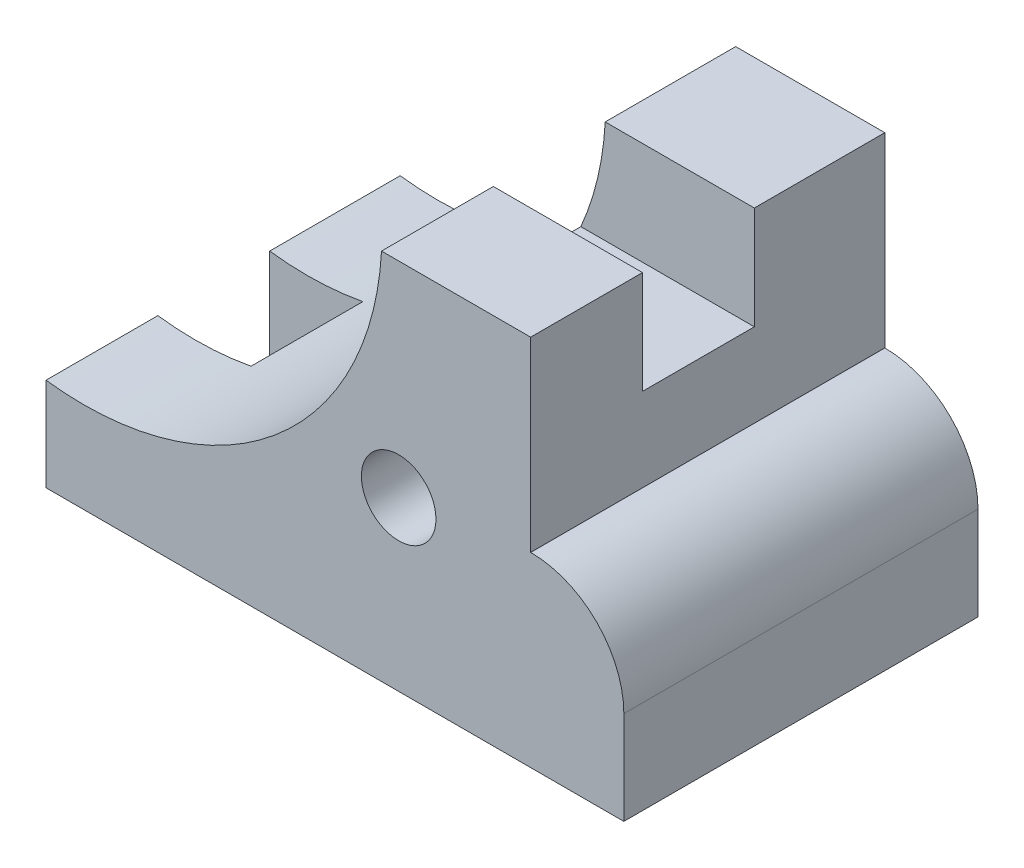
ISO-10303-21;
HEADER;
FILE_DESCRIPTION(('STEP AP214'),'2;1');
FILE_NAME('part.step','',(''),(''),'','','');
FILE_SCHEMA(('AUTOMOTIVE_DESIGN { 1 0 10303 214 1 1 1 1 }'));
ENDSEC;
DATA;
#1=APPLICATION_CONTEXT('core data for automotive mechanical design processes');
#2=APPLICATION_PROTOCOL_DEFINITION('international standard','automotive_design',2000,#1);
#3=PRODUCT_CONTEXT('',#1,'mechanical');
#4=PRODUCT('Part','Part','',(#3));
#5=PRODUCT_RELATED_PRODUCT_CATEGORY('part','',(#4));
#6=PRODUCT_DEFINITION_FORMATION('','',#4);
#7=PRODUCT_DEFINITION_CONTEXT('part definition',#1,'design');
#8=PRODUCT_DEFINITION('design','',#6,#7);
#9=PRODUCT_DEFINITION_SHAPE('','',#8);
#10=(LENGTH_UNIT() NAMED_UNIT(*) SI_UNIT(.MILLI.,.METRE.));
#11=(NAMED_UNIT(*) PLANE_ANGLE_UNIT() SI_UNIT($,.RADIAN.));
#12=(NAMED_UNIT(*) SI_UNIT($,.STERADIAN.) SOLID_ANGLE_UNIT());
#13=UNCERTAINTY_MEASURE_WITH_UNIT(LENGTH_MEASURE(1.E-05),#10,'distance_accuracy_value','');
#14=(GEOMETRIC_REPRESENTATION_CONTEXT(3) GLOBAL_UNCERTAINTY_ASSIGNED_CONTEXT((#13)) GLOBAL_UNIT_ASSIGNED_CONTEXT((#10,
#11,#12)) REPRESENTATION_CONTEXT('',''));
#15=CARTESIAN_POINT('',(0.,0.,0.));
#16=DIRECTION('',(0.,0.,1.));
#17=DIRECTION('',(1.,0.,0.));
#18=AXIS2_PLACEMENT_3D('',#15,#16,#17);
#19=CARTESIAN_POINT('',(0.,0.,-60.325));
#20=DIRECTION('',(-1.,0.,0.));
#21=DIRECTION('',(0.,0.,1.));
#22=AXIS2_PLACEMENT_3D('',#19,#20,#21);
#23=PLANE('',#22);
#24=DIRECTION('',(0.,0.,1.));
#25=VECTOR('',#24,1.);
#26=CARTESIAN_POINT('',(0.,15.875,-60.325));
#27=LINE('',#26,#25);
#28=CARTESIAN_POINT('',(0.,15.875,-19.05));
#29=VERTEX_POINT('',#28);
#30=CARTESIAN_POINT('',(0.,15.875,0.));
#31=VERTEX_POINT('',#30);
#32=EDGE_CURVE('E44',#29,#31,#27,.T.);
#33=ORIENTED_EDGE('',*,*,#32,.F.);
#34=DIRECTION('',(0.,-1.,0.));
#35=VECTOR('',#34,1.);
#36=CARTESIAN_POINT('',(0.,29.8196,-19.05));
#37=LINE('',#36,#35);
#38=CARTESIAN_POINT('',(0.,0.,-19.05));
#39=VERTEX_POINT('',#38);
#40=EDGE_CURVE('E183',#29,#39,#37,.T.);
#41=ORIENTED_EDGE('',*,*,#40,.T.);
#42=DIRECTION('',(0.,0.,1.));
#43=VECTOR('',#42,1.);
#44=CARTESIAN_POINT('',(0.,0.,-60.325));
#45=LINE('',#44,#43);
#46=CARTESIAN_POINT('',(0.,0.,0.));
#47=VERTEX_POINT('',#46);
#48=EDGE_CURVE('E174',#39,#47,#45,.T.);
#49=ORIENTED_EDGE('',*,*,#48,.T.);
#50=DIRECTION('',(0.,-1.,0.));
#51=VECTOR('',#50,1.);
#52=CARTESIAN_POINT('',(0.,0.,0.));
#53=LINE('',#52,#51);
#54=EDGE_CURVE('E214',#31,#47,#53,.T.);
#55=ORIENTED_EDGE('',*,*,#54,.F.);
#56=EDGE_LOOP('',(#33,#41,#49,#55));
#57=FACE_BOUND('',#56,.T.);
#58=ADVANCED_FACE('F35',(#57),#23,.T.);
#59=CARTESIAN_POINT('',(6.42715939254242,66.2649087289491,-60.325));
#60=DIRECTION('',(0.,0.,1.));
#61=DIRECTION('',(1.,0.,0.));
#62=AXIS2_PLACEMENT_3D('',#59,#60,#61);
#63=CYLINDRICAL_SURFACE('',#62,50.7981424814822);
#64=DIRECTION('',(0.,0.,1.));
#65=VECTOR('',#64,1.);
#66=CARTESIAN_POINT('',(15.875,16.3530906151492,-60.325));
#67=LINE('',#66,#65);
#68=CARTESIAN_POINT('',(15.875,16.3530906151492,-19.05));
#69=VERTEX_POINT('',#68);
#70=CARTESIAN_POINT('',(15.875,16.3530906151492,-38.1));
#71=VERTEX_POINT('',#70);
#72=EDGE_CURVE('E188',#69,#71,#67,.F.);
#73=ORIENTED_EDGE('',*,*,#72,.F.);
#74=CARTESIAN_POINT('',(6.42715939254242,66.2649087289491,-19.05));
#75=DIRECTION('',(0.,0.,-1.));
#76=DIRECTION('',(-1.,0.,0.));
#77=AXIS2_PLACEMENT_3D('',#74,#75,#76);
#78=CIRCLE('',#77,50.7981424814822);
#79=EDGE_CURVE('E158',#69,#29,#78,.T.);
#80=ORIENTED_EDGE('',*,*,#79,.T.);
#81=ORIENTED_EDGE('',*,*,#32,.T.);
#82=CARTESIAN_POINT('',(6.42715939254242,66.2649087289491,0.));
#83=DIRECTION('',(0.,0.,-1.));
#84=DIRECTION('',(1.,0.,0.));
#85=AXIS2_PLACEMENT_3D('',#82,#83,#84);
#86=CIRCLE('',#85,50.7981424814822);
#87=CARTESIAN_POINT('',(57.15,63.5,0.));
#88=VERTEX_POINT('',#87);
#89=EDGE_CURVE('E219',#88,#31,#86,.T.);
#90=ORIENTED_EDGE('',*,*,#89,.F.);
#91=DIRECTION('',(0.,0.,1.));
#92=VECTOR('',#91,1.);
#93=CARTESIAN_POINT('',(57.15,63.5,-60.325));
#94=LINE('',#93,#92);
#95=CARTESIAN_POINT('',(57.15,63.5,-19.05));
#96=VERTEX_POINT('',#95);
#97=EDGE_CURVE('E264',#96,#88,#94,.T.);
#98=ORIENTED_EDGE('',*,*,#97,.F.);
#99=CARTESIAN_POINT('',(6.42715939254242,66.2649087289491,-19.05));
#100=DIRECTION('',(0.,0.,1.));
#101=DIRECTION('',(0.,-1.,0.));
#102=AXIS2_PLACEMENT_3D('',#99,#100,#101);
#103=CIRCLE('',#102,50.7981424814822);
#104=CARTESIAN_POINT('',(52.9967879343552,45.974,-19.05));
#105=VERTEX_POINT('',#104);
#106=EDGE_CURVE('E210',#105,#96,#103,.T.);
#107=ORIENTED_EDGE('',*,*,#106,.F.);
#108=DIRECTION('',(0.,0.,1.));
#109=VECTOR('',#108,1.);
#110=CARTESIAN_POINT('',(52.9967879343552,45.974,-60.325));
#111=LINE('',#110,#109);
#112=CARTESIAN_POINT('',(52.9967879343552,45.974,-38.1));
#113=VERTEX_POINT('',#112);
#114=EDGE_CURVE('E212',#113,#105,#111,.T.);
#115=ORIENTED_EDGE('',*,*,#114,.F.);
#116=CARTESIAN_POINT('',(6.42715939254242,66.2649087289491,-38.1));
#117=DIRECTION('',(0.,0.,1.));
#118=DIRECTION('',(1.,0.,0.));
#119=AXIS2_PLACEMENT_3D('',#116,#117,#118);
#120=CIRCLE('',#119,50.7981424814822);
#121=CARTESIAN_POINT('',(57.15,63.5,-38.1));
#122=VERTEX_POINT('',#121);
#123=EDGE_CURVE('E201',#113,#122,#120,.T.);
#124=ORIENTED_EDGE('',*,*,#123,.T.);
#125=CARTESIAN_POINT('',(57.15,63.5,-60.325));
#126=VERTEX_POINT('',#125);
#127=EDGE_CURVE('E261',#126,#122,#94,.T.);
#128=ORIENTED_EDGE('',*,*,#127,.F.);
#129=CARTESIAN_POINT('',(6.42715939254242,66.2649087289491,-60.325));
#130=DIRECTION('',(0.,0.,-1.));
#131=DIRECTION('',(1.,0.,0.));
#132=AXIS2_PLACEMENT_3D('',#129,#130,#131);
#133=CIRCLE('',#132,50.7981424814822);
#134=CARTESIAN_POINT('',(0.,15.875,-60.325));
#135=VERTEX_POINT('',#134);
#136=EDGE_CURVE('E236',#126,#135,#133,.T.);
#137=ORIENTED_EDGE('',*,*,#136,.T.);
#138=CARTESIAN_POINT('',(0.,15.875,-38.1));
#139=VERTEX_POINT('',#138);
#140=EDGE_CURVE('E11',#135,#139,#27,.T.);
#141=ORIENTED_EDGE('',*,*,#140,.T.);
#142=CARTESIAN_POINT('',(6.42715939254242,66.2649087289491,-38.1));
#143=DIRECTION('',(0.,0.,-1.));
#144=DIRECTION('',(-1.,0.,0.));
#145=AXIS2_PLACEMENT_3D('',#142,#143,#144);
#146=CIRCLE('',#145,50.7981424814822);
#147=EDGE_CURVE('E161',#71,#139,#146,.T.);
#148=ORIENTED_EDGE('',*,*,#147,.F.);
#149=EDGE_LOOP('',(#73,#80,#81,#90,#98,#107,#115,#124,#128,#137,#141,#148));
#150=FACE_BOUND('',#149,.T.);
#151=ADVANCED_FACE('F288',(#150),#63,.F.);
#152=CARTESIAN_POINT('',(82.55,0.,-60.325));
#153=DIRECTION('',(0.,-1.,0.));
#154=DIRECTION('',(0.,0.,-1.));
#155=AXIS2_PLACEMENT_3D('',#152,#153,#154);
#156=PLANE('',#155);
#157=ORIENTED_EDGE('',*,*,#48,.F.);
#158=DIRECTION('',(1.,0.,0.));
#159=VECTOR('',#158,1.);
#160=CARTESIAN_POINT('',(0.,0.,-19.05));
#161=LINE('',#160,#159);
#162=CARTESIAN_POINT('',(15.875,0.,-19.05));
#163=VERTEX_POINT('',#162);
#164=EDGE_CURVE('E155',#39,#163,#161,.T.);
#165=ORIENTED_EDGE('',*,*,#164,.T.);
#166=DIRECTION('',(0.,0.,1.));
#167=VECTOR('',#166,1.);
#168=CARTESIAN_POINT('',(15.875,0.,-38.1));
#169=LINE('',#168,#167);
#170=CARTESIAN_POINT('',(15.875,0.,-38.1));
#171=VERTEX_POINT('',#170);
#172=EDGE_CURVE('E165',#171,#163,#169,.T.);
#173=ORIENTED_EDGE('',*,*,#172,.F.);
#174=DIRECTION('',(1.,0.,0.));
#175=VECTOR('',#174,1.);
#176=CARTESIAN_POINT('',(0.,0.,-38.1));
#177=LINE('',#176,#175);
#178=CARTESIAN_POINT('',(0.,0.,-38.1));
#179=VERTEX_POINT('',#178);
#180=EDGE_CURVE('E169',#179,#171,#177,.T.);
#181=ORIENTED_EDGE('',*,*,#180,.F.);
#182=CARTESIAN_POINT('',(0.,0.,-60.325));
#183=VERTEX_POINT('',#182);
#184=EDGE_CURVE('E39',#183,#179,#45,.T.);
#185=ORIENTED_EDGE('',*,*,#184,.F.);
#186=DIRECTION('',(1.,0.,0.));
#187=VECTOR('',#186,1.);
#188=CARTESIAN_POINT('',(0.,0.,-60.325));
#189=LINE('',#188,#187);
#190=CARTESIAN_POINT('',(98.425,0.,-60.325));
#191=VERTEX_POINT('',#190);
#192=EDGE_CURVE('E218',#183,#191,#189,.T.);
#193=ORIENTED_EDGE('',*,*,#192,.T.);
#194=DIRECTION('',(0.,0.,1.));
#195=VECTOR('',#194,1.);
#196=CARTESIAN_POINT('',(98.425,0.,-60.325));
#197=LINE('',#196,#195);
#198=CARTESIAN_POINT('',(98.425,0.,0.));
#199=VERTEX_POINT('',#198);
#200=EDGE_CURVE('E274',#191,#199,#197,.T.);
#201=ORIENTED_EDGE('',*,*,#200,.T.);
#202=DIRECTION('',(1.,0.,0.));
#203=VECTOR('',#202,1.);
#204=CARTESIAN_POINT('',(82.55,0.,0.));
#205=LINE('',#204,#203);
#206=EDGE_CURVE('E241',#47,#199,#205,.T.);
#207=ORIENTED_EDGE('',*,*,#206,.F.);
#208=EDGE_LOOP('',(#157,#165,#173,#181,#185,#193,#201,#207));
#209=FACE_BOUND('',#208,.T.);
#210=ADVANCED_FACE('F172',(#209),#156,.T.);
#211=CARTESIAN_POINT('',(57.15,63.5,-60.325));
#212=DIRECTION('',(0.,1.,0.));
#213=DIRECTION('',(0.,0.,1.));
#214=AXIS2_PLACEMENT_3D('',#211,#212,#213);
#215=PLANE('',#214);
#216=ORIENTED_EDGE('',*,*,#127,.T.);
#217=DIRECTION('',(1.,0.,0.));
#218=VECTOR('',#217,1.);
#219=CARTESIAN_POINT('',(52.7304,63.5,-38.1));
#220=LINE('',#219,#218);
#221=CARTESIAN_POINT('',(82.55,63.5,-38.1));
#222=VERTEX_POINT('',#221);
#223=EDGE_CURVE('E204',#122,#222,#220,.T.);
#224=ORIENTED_EDGE('',*,*,#223,.T.);
#225=DIRECTION('',(0.,0.,1.));
#226=VECTOR('',#225,1.);
#227=CARTESIAN_POINT('',(82.55,63.5,-60.325));
#228=LINE('',#227,#226);
#229=CARTESIAN_POINT('',(82.55,63.5,-60.325));
#230=VERTEX_POINT('',#229);
#231=EDGE_CURVE('E265',#230,#222,#228,.T.);
#232=ORIENTED_EDGE('',*,*,#231,.F.);
#233=DIRECTION('',(-1.,0.,0.));
#234=VECTOR('',#233,1.);
#235=CARTESIAN_POINT('',(57.15,63.5,-60.325));
#236=LINE('',#235,#234);
#237=EDGE_CURVE('E233',#230,#126,#236,.T.);
#238=ORIENTED_EDGE('',*,*,#237,.T.);
#239=EDGE_LOOP('',(#216,#224,#232,#238));
#240=FACE_BOUND('',#239,.T.);
#241=ADVANCED_FACE('F331',(#240),#215,.T.);
#242=DIRECTION('',(0.,-1.,0.));
#243=VECTOR('',#242,1.);
#244=CARTESIAN_POINT('',(0.,29.8196,-38.1));
#245=LINE('',#244,#243);
#246=EDGE_CURVE('E52',#139,#179,#245,.T.);
#247=ORIENTED_EDGE('',*,*,#246,.F.);
#248=ORIENTED_EDGE('',*,*,#140,.F.);
#249=DIRECTION('',(0.,-1.,0.));
#250=VECTOR('',#249,1.);
#251=CARTESIAN_POINT('',(0.,0.,-60.325));
#252=LINE('',#251,#250);
#253=EDGE_CURVE('E215',#135,#183,#252,.T.);
#254=ORIENTED_EDGE('',*,*,#253,.T.);
#255=ORIENTED_EDGE('',*,*,#184,.T.);
#256=EDGE_LOOP('',(#247,#248,#254,#255));
#257=FACE_BOUND('',#256,.T.);
#258=ADVANCED_FACE('F37',(#257),#23,.T.);
#259=DIRECTION('',(1.,0.,0.));
#260=VECTOR('',#259,1.);
#261=CARTESIAN_POINT('',(52.7304,63.5,-19.05));
#262=LINE('',#261,#260);
#263=CARTESIAN_POINT('',(82.55,63.5,-19.05));
#264=VERTEX_POINT('',#263);
#265=EDGE_CURVE('E202',#96,#264,#262,.T.);
#266=ORIENTED_EDGE('',*,*,#265,.F.);
#267=ORIENTED_EDGE('',*,*,#97,.T.);
#268=DIRECTION('',(-1.,0.,0.));
#269=VECTOR('',#268,1.);
#270=CARTESIAN_POINT('',(57.15,63.5,0.));
#271=LINE('',#270,#269);
#272=CARTESIAN_POINT('',(82.55,63.5,0.));
#273=VERTEX_POINT('',#272);
#274=EDGE_CURVE('E256',#273,#88,#271,.T.);
#275=ORIENTED_EDGE('',*,*,#274,.F.);
#276=EDGE_CURVE('E268',#264,#273,#228,.T.);
#277=ORIENTED_EDGE('',*,*,#276,.F.);
#278=EDGE_LOOP('',(#266,#267,#275,#277));
#279=FACE_BOUND('',#278,.T.);
#280=ADVANCED_FACE('F330',(#279),#215,.T.);
#281=CARTESIAN_POINT('',(82.55,31.75,-60.325));
#282=DIRECTION('',(1.,0.,0.));
#283=DIRECTION('',(0.,0.,-1.));
#284=AXIS2_PLACEMENT_3D('',#281,#282,#283);
#285=PLANE('',#284);
#286=DIRECTION('',(0.,-1.,0.));
#287=VECTOR('',#286,1.);
#288=CARTESIAN_POINT('',(82.55,63.5,-19.05));
#289=LINE('',#288,#287);
#290=CARTESIAN_POINT('',(82.55,45.974,-19.05));
#291=VERTEX_POINT('',#290);
#292=EDGE_CURVE('E195',#264,#291,#289,.T.);
#293=ORIENTED_EDGE('',*,*,#292,.F.);
#294=ORIENTED_EDGE('',*,*,#276,.T.);
#295=DIRECTION('',(0.,1.,0.));
#296=VECTOR('',#295,1.);
#297=CARTESIAN_POINT('',(82.55,31.75,0.));
#298=LINE('',#297,#296);
#299=CARTESIAN_POINT('',(82.55,31.75,0.));
#300=VERTEX_POINT('',#299);
#301=EDGE_CURVE('E253',#300,#273,#298,.T.);
#302=ORIENTED_EDGE('',*,*,#301,.F.);
#303=DIRECTION('',(0.,0.,1.));
#304=VECTOR('',#303,1.);
#305=CARTESIAN_POINT('',(82.55,31.75,-60.325));
#306=LINE('',#305,#304);
#307=CARTESIAN_POINT('',(82.55,31.75,-60.325));
#308=VERTEX_POINT('',#307);
#309=EDGE_CURVE('E269',#308,#300,#306,.T.);
#310=ORIENTED_EDGE('',*,*,#309,.F.);
#311=DIRECTION('',(0.,1.,0.));
#312=VECTOR('',#311,1.);
#313=CARTESIAN_POINT('',(82.55,31.75,-60.325));
#314=LINE('',#313,#312);
#315=EDGE_CURVE('E230',#308,#230,#314,.T.);
#316=ORIENTED_EDGE('',*,*,#315,.T.);
#317=ORIENTED_EDGE('',*,*,#231,.T.);
#318=DIRECTION('',(0.,-1.,0.));
#319=VECTOR('',#318,1.);
#320=CARTESIAN_POINT('',(82.55,63.5,-38.1));
#321=LINE('',#320,#319);
#322=CARTESIAN_POINT('',(82.55,45.974,-38.1));
#323=VERTEX_POINT('',#322);
#324=EDGE_CURVE('E192',#222,#323,#321,.T.);
#325=ORIENTED_EDGE('',*,*,#324,.T.);
#326=DIRECTION('',(0.,0.,-1.));
#327=VECTOR('',#326,1.);
#328=CARTESIAN_POINT('',(82.55,45.974,-19.05));
#329=LINE('',#328,#327);
#330=EDGE_CURVE('E60',#291,#323,#329,.T.);
#331=ORIENTED_EDGE('',*,*,#330,.F.);
#332=EDGE_LOOP('',(#293,#294,#302,#310,#316,#317,#325,#331));
#333=FACE_BOUND('',#332,.T.);
#334=ADVANCED_FACE('F305',(#333),#285,.T.);
#335=CARTESIAN_POINT('',(82.55,31.75,-60.325));
#336=DIRECTION('',(0.,1.,0.));
#337=DIRECTION('',(0.,0.,1.));
#338=AXIS2_PLACEMENT_3D('',#335,#336,#337);
#339=PLANE('',#338);
#340=DIRECTION('',(-1.,0.,0.));
#341=VECTOR('',#340,1.);
#342=CARTESIAN_POINT('',(82.55,31.75,0.));
#343=LINE('',#342,#341);
#344=CARTESIAN_POINT('',(82.5753999999999,31.75,0.));
#345=VERTEX_POINT('',#344);
#346=EDGE_CURVE('E250',#345,#300,#343,.T.);
#347=ORIENTED_EDGE('',*,*,#346,.F.);
#348=DIRECTION('',(0.,0.,1.));
#349=VECTOR('',#348,1.);
#350=CARTESIAN_POINT('',(82.5753999999999,31.75,-60.325));
#351=LINE('',#350,#349);
#352=CARTESIAN_POINT('',(82.5753999999999,31.75,-60.325));
#353=VERTEX_POINT('',#352);
#354=EDGE_CURVE('E271',#353,#345,#351,.T.);
#355=ORIENTED_EDGE('',*,*,#354,.F.);
#356=DIRECTION('',(-1.,0.,0.));
#357=VECTOR('',#356,1.);
#358=CARTESIAN_POINT('',(82.55,31.75,-60.325));
#359=LINE('',#358,#357);
#360=EDGE_CURVE('E227',#353,#308,#359,.T.);
#361=ORIENTED_EDGE('',*,*,#360,.T.);
#362=ORIENTED_EDGE('',*,*,#309,.T.);
#363=EDGE_LOOP('',(#347,#355,#361,#362));
#364=FACE_BOUND('',#363,.T.);
#365=ADVANCED_FACE('F309',(#364),#339,.T.);
#366=CARTESIAN_POINT('',(82.5754,15.9004,-60.325));
#367=DIRECTION('',(0.,0.,1.));
#368=DIRECTION('',(1.,0.,0.));
#369=AXIS2_PLACEMENT_3D('',#366,#367,#368);
#370=CYLINDRICAL_SURFACE('',#369,15.8496);
#371=CARTESIAN_POINT('',(82.5754,15.9004,0.));
#372=DIRECTION('',(0.,0.,1.));
#373=DIRECTION('',(-1.,0.,0.));
#374=AXIS2_PLACEMENT_3D('',#371,#372,#373);
#375=CIRCLE('',#374,15.8496);
#376=CARTESIAN_POINT('',(98.425,15.9003999999999,0.));
#377=VERTEX_POINT('',#376);
#378=EDGE_CURVE('E247',#377,#345,#375,.T.);
#379=ORIENTED_EDGE('',*,*,#378,.F.);
#380=DIRECTION('',(0.,0.,1.));
#381=VECTOR('',#380,1.);
#382=CARTESIAN_POINT('',(98.425,15.9003999999999,-60.325));
#383=LINE('',#382,#381);
#384=CARTESIAN_POINT('',(98.425,15.9003999999999,-60.325));
#385=VERTEX_POINT('',#384);
#386=EDGE_CURVE('E273',#385,#377,#383,.T.);
#387=ORIENTED_EDGE('',*,*,#386,.F.);
#388=CARTESIAN_POINT('',(82.5754,15.9004,-60.325));
#389=DIRECTION('',(0.,0.,1.));
#390=DIRECTION('',(-1.,0.,0.));
#391=AXIS2_PLACEMENT_3D('',#388,#389,#390);
#392=CIRCLE('',#391,15.8496);
#393=EDGE_CURVE('E224',#385,#353,#392,.T.);
#394=ORIENTED_EDGE('',*,*,#393,.T.);
#395=ORIENTED_EDGE('',*,*,#354,.T.);
#396=EDGE_LOOP('',(#379,#387,#394,#395));
#397=FACE_BOUND('',#396,.T.);
#398=ADVANCED_FACE('F312',(#397),#370,.T.);
#399=CARTESIAN_POINT('',(98.425,0.,-60.325));
#400=DIRECTION('',(1.,0.,0.));
#401=DIRECTION('',(0.,0.,-1.));
#402=AXIS2_PLACEMENT_3D('',#399,#400,#401);
#403=PLANE('',#402);
#404=DIRECTION('',(0.,1.,0.));
#405=VECTOR('',#404,1.);
#406=CARTESIAN_POINT('',(98.425,0.,0.));
#407=LINE('',#406,#405);
#408=EDGE_CURVE('E244',#199,#377,#407,.T.);
#409=ORIENTED_EDGE('',*,*,#408,.F.);
#410=ORIENTED_EDGE('',*,*,#200,.F.);
#411=DIRECTION('',(0.,1.,0.));
#412=VECTOR('',#411,1.);
#413=CARTESIAN_POINT('',(98.425,0.,-60.325));
#414=LINE('',#413,#412);
#415=EDGE_CURVE('E221',#191,#385,#414,.T.);
#416=ORIENTED_EDGE('',*,*,#415,.T.);
#417=ORIENTED_EDGE('',*,*,#386,.T.);
#418=EDGE_LOOP('',(#409,#410,#416,#417));
#419=FACE_BOUND('',#418,.T.);
#420=ADVANCED_FACE('F314',(#419),#403,.T.);
#421=CARTESIAN_POINT('',(6.42715939254242,66.2649087289491,-60.325));
#422=DIRECTION('',(0.,0.,1.));
#423=DIRECTION('',(1.,0.,0.));
#424=AXIS2_PLACEMENT_3D('',#421,#422,#423);
#425=PLANE('',#424);
#426=CARTESIAN_POINT('',(60.071,28.575,-60.325));
#427=DIRECTION('',(0.,0.,1.));
#428=DIRECTION('',(1.,0.,0.));
#429=AXIS2_PLACEMENT_3D('',#426,#427,#428);
#430=CIRCLE('',#429,6.35);
#431=CARTESIAN_POINT('',(66.421,28.575,-60.325));
#432=VERTEX_POINT('',#431);
#433=EDGE_CURVE('E175',#432,#432,#430,.T.);
#434=ORIENTED_EDGE('',*,*,#433,.T.);
#435=EDGE_LOOP('',(#434));
#436=FACE_BOUND('',#435,.T.);
#437=ORIENTED_EDGE('',*,*,#253,.F.);
#438=ORIENTED_EDGE('',*,*,#136,.F.);
#439=ORIENTED_EDGE('',*,*,#237,.F.);
#440=ORIENTED_EDGE('',*,*,#315,.F.);
#441=ORIENTED_EDGE('',*,*,#360,.F.);
#442=ORIENTED_EDGE('',*,*,#393,.F.);
#443=ORIENTED_EDGE('',*,*,#415,.F.);
#444=ORIENTED_EDGE('',*,*,#192,.F.);
#445=EDGE_LOOP('',(#437,#438,#439,#440,#441,#442,#443,#444));
#446=FACE_BOUND('',#445,.T.);
#447=ADVANCED_FACE('F296',(#436,#446),#425,.F.);
#448=CARTESIAN_POINT('',(6.42715939254242,66.2649087289491,0.));
#449=DIRECTION('',(0.,0.,1.));
#450=DIRECTION('',(1.,0.,0.));
#451=AXIS2_PLACEMENT_3D('',#448,#449,#450);
#452=PLANE('',#451);
#453=CARTESIAN_POINT('',(60.071,28.575,0.));
#454=DIRECTION('',(0.,0.,1.));
#455=DIRECTION('',(1.,0.,0.));
#456=AXIS2_PLACEMENT_3D('',#453,#454,#455);
#457=CIRCLE('',#456,6.35);
#458=CARTESIAN_POINT('',(66.421,28.575,0.));
#459=VERTEX_POINT('',#458);
#460=EDGE_CURVE('E178',#459,#459,#457,.T.);
#461=ORIENTED_EDGE('',*,*,#460,.F.);
#462=EDGE_LOOP('',(#461));
#463=FACE_BOUND('',#462,.T.);
#464=ORIENTED_EDGE('',*,*,#54,.T.);
#465=ORIENTED_EDGE('',*,*,#206,.T.);
#466=ORIENTED_EDGE('',*,*,#408,.T.);
#467=ORIENTED_EDGE('',*,*,#378,.T.);
#468=ORIENTED_EDGE('',*,*,#346,.T.);
#469=ORIENTED_EDGE('',*,*,#301,.T.);
#470=ORIENTED_EDGE('',*,*,#274,.T.);
#471=ORIENTED_EDGE('',*,*,#89,.T.);
#472=EDGE_LOOP('',(#464,#465,#466,#467,#468,#469,#470,#471));
#473=FACE_BOUND('',#472,.T.);
#474=ADVANCED_FACE('F283',(#463,#473),#452,.T.);
#475=CARTESIAN_POINT('',(52.7304,45.974,-19.05));
#476=DIRECTION('',(0.,-1.,0.));
#477=DIRECTION('',(0.,0.,-1.));
#478=AXIS2_PLACEMENT_3D('',#475,#476,#477);
#479=PLANE('',#478);
#480=ORIENTED_EDGE('',*,*,#114,.T.);
#481=DIRECTION('',(1.,0.,0.));
#482=VECTOR('',#481,1.);
#483=CARTESIAN_POINT('',(52.7304,45.974,-19.05));
#484=LINE('',#483,#482);
#485=EDGE_CURVE('E199',#105,#291,#484,.T.);
#486=ORIENTED_EDGE('',*,*,#485,.T.);
#487=ORIENTED_EDGE('',*,*,#330,.T.);
#488=DIRECTION('',(1.,0.,0.));
#489=VECTOR('',#488,1.);
#490=CARTESIAN_POINT('',(52.7304,45.974,-38.1));
#491=LINE('',#490,#489);
#492=EDGE_CURVE('E198',#113,#323,#491,.T.);
#493=ORIENTED_EDGE('',*,*,#492,.F.);
#494=EDGE_LOOP('',(#480,#486,#487,#493));
#495=FACE_BOUND('',#494,.T.);
#496=ADVANCED_FACE('F381',(#495),#479,.F.);
#497=CARTESIAN_POINT('',(52.7304,63.5,-19.05));
#498=DIRECTION('',(0.,0.,1.));
#499=DIRECTION('',(0.,-1.,0.));
#500=AXIS2_PLACEMENT_3D('',#497,#498,#499);
#501=PLANE('',#500);
#502=ORIENTED_EDGE('',*,*,#106,.T.);
#503=ORIENTED_EDGE('',*,*,#265,.T.);
#504=ORIENTED_EDGE('',*,*,#292,.T.);
#505=ORIENTED_EDGE('',*,*,#485,.F.);
#506=EDGE_LOOP('',(#502,#503,#504,#505));
#507=FACE_BOUND('',#506,.T.);
#508=ADVANCED_FACE('F385',(#507),#501,.F.);
#509=CARTESIAN_POINT('',(52.7304,63.5,-38.1));
#510=DIRECTION('',(0.,0.,1.));
#511=DIRECTION('',(1.,0.,0.));
#512=AXIS2_PLACEMENT_3D('',#509,#510,#511);
#513=PLANE('',#512);
#514=ORIENTED_EDGE('',*,*,#492,.T.);
#515=ORIENTED_EDGE('',*,*,#324,.F.);
#516=ORIENTED_EDGE('',*,*,#223,.F.);
#517=ORIENTED_EDGE('',*,*,#123,.F.);
#518=EDGE_LOOP('',(#514,#515,#516,#517));
#519=FACE_BOUND('',#518,.T.);
#520=ADVANCED_FACE('F395',(#519),#513,.T.);
#521=CARTESIAN_POINT('',(0.,29.8196,-19.05));
#522=DIRECTION('',(0.,0.,-1.));
#523=DIRECTION('',(-1.,0.,0.));
#524=AXIS2_PLACEMENT_3D('',#521,#522,#523);
#525=PLANE('',#524);
#526=DIRECTION('',(0.,-1.,0.));
#527=VECTOR('',#526,1.);
#528=CARTESIAN_POINT('',(15.875,29.8196,-19.05));
#529=LINE('',#528,#527);
#530=EDGE_CURVE('E151',#69,#163,#529,.T.);
#531=ORIENTED_EDGE('',*,*,#530,.T.);
#532=ORIENTED_EDGE('',*,*,#164,.F.);
#533=ORIENTED_EDGE('',*,*,#40,.F.);
#534=ORIENTED_EDGE('',*,*,#79,.F.);
#535=EDGE_LOOP('',(#531,#532,#533,#534));
#536=FACE_BOUND('',#535,.T.);
#537=ADVANCED_FACE('F153',(#536),#525,.T.);
#538=CARTESIAN_POINT('',(15.875,29.8196,-38.1));
#539=DIRECTION('',(1.,0.,0.));
#540=DIRECTION('',(0.,0.,-1.));
#541=AXIS2_PLACEMENT_3D('',#538,#539,#540);
#542=PLANE('',#541);
#543=ORIENTED_EDGE('',*,*,#72,.T.);
#544=DIRECTION('',(0.,-1.,0.));
#545=VECTOR('',#544,1.);
#546=CARTESIAN_POINT('',(15.875,29.8196,-38.1));
#547=LINE('',#546,#545);
#548=EDGE_CURVE('E162',#71,#171,#547,.T.);
#549=ORIENTED_EDGE('',*,*,#548,.T.);
#550=ORIENTED_EDGE('',*,*,#172,.T.);
#551=ORIENTED_EDGE('',*,*,#530,.F.);
#552=EDGE_LOOP('',(#543,#549,#550,#551));
#553=FACE_BOUND('',#552,.T.);
#554=ADVANCED_FACE('F166',(#553),#542,.F.);
#555=CARTESIAN_POINT('',(0.,29.8196,-38.1));
#556=DIRECTION('',(0.,0.,-1.));
#557=DIRECTION('',(-1.,0.,0.));
#558=AXIS2_PLACEMENT_3D('',#555,#556,#557);
#559=PLANE('',#558);
#560=ORIENTED_EDGE('',*,*,#147,.T.);
#561=ORIENTED_EDGE('',*,*,#246,.T.);
#562=ORIENTED_EDGE('',*,*,#180,.T.);
#563=ORIENTED_EDGE('',*,*,#548,.F.);
#564=EDGE_LOOP('',(#560,#561,#562,#563));
#565=FACE_BOUND('',#564,.T.);
#566=ADVANCED_FACE('F291',(#565),#559,.F.);
#567=CARTESIAN_POINT('',(60.071,28.575,-60.3504));
#568=DIRECTION('',(0.,0.,1.));
#569=DIRECTION('',(1.,0.,0.));
#570=AXIS2_PLACEMENT_3D('',#567,#568,#569);
#571=CYLINDRICAL_SURFACE('',#570,6.35);
#572=ORIENTED_EDGE('',*,*,#460,.T.);
#573=EDGE_LOOP('',(#572));
#574=FACE_BOUND('',#573,.T.);
#575=ORIENTED_EDGE('',*,*,#433,.F.);
#576=EDGE_LOOP('',(#575));
#577=FACE_BOUND('',#576,.T.);
#578=ADVANCED_FACE('F450',(#574,#577),#571,.F.);
#579=CLOSED_SHELL('',(#58,#151,#210,#241,#258,#280,#334,#365,#398,#420,#447,#474,#496,#508,#520,
#537,#554,#566,#578));
#580=MANIFOLD_SOLID_BREP('B2',#579);
#581=ADVANCED_BREP_SHAPE_REPRESENTATION('',(#18,#580),#14);
#582=SHAPE_DEFINITION_REPRESENTATION(#9,#581);
ENDSEC;
END-ISO-10303-21;
